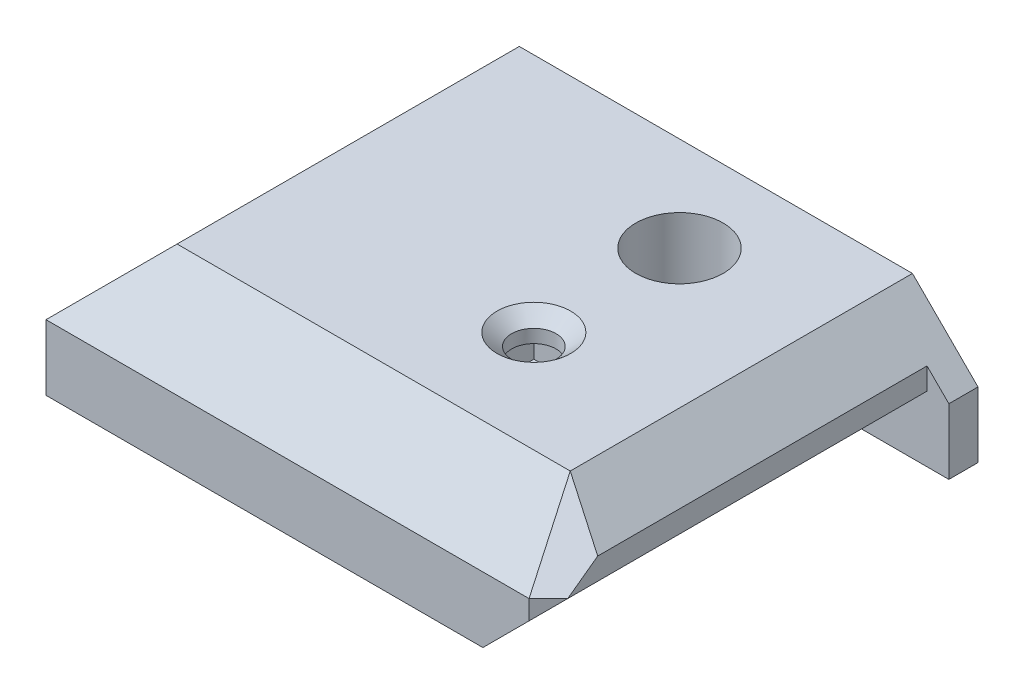
ISO-10303-21;
HEADER;
FILE_DESCRIPTION(('STEP AP214'),'2;1');
FILE_NAME('part.step','',(''),(''),'','','');
FILE_SCHEMA(('AUTOMOTIVE_DESIGN { 1 0 10303 214 1 1 1 1 }'));
ENDSEC;
DATA;
#1=APPLICATION_CONTEXT('core data for automotive mechanical design processes');
#2=APPLICATION_PROTOCOL_DEFINITION('international standard','automotive_design',2000,#1);
#3=PRODUCT_CONTEXT('',#1,'mechanical');
#4=PRODUCT('Part','Part','',(#3));
#5=PRODUCT_RELATED_PRODUCT_CATEGORY('part','',(#4));
#6=PRODUCT_DEFINITION_FORMATION('','',#4);
#7=PRODUCT_DEFINITION_CONTEXT('part definition',#1,'design');
#8=PRODUCT_DEFINITION('design','',#6,#7);
#9=PRODUCT_DEFINITION_SHAPE('','',#8);
#10=(LENGTH_UNIT() NAMED_UNIT(*) SI_UNIT(.MILLI.,.METRE.));
#11=(NAMED_UNIT(*) PLANE_ANGLE_UNIT() SI_UNIT($,.RADIAN.));
#12=(NAMED_UNIT(*) SI_UNIT($,.STERADIAN.) SOLID_ANGLE_UNIT());
#13=UNCERTAINTY_MEASURE_WITH_UNIT(LENGTH_MEASURE(1.E-05),#10,'distance_accuracy_value','');
#14=(GEOMETRIC_REPRESENTATION_CONTEXT(3) GLOBAL_UNCERTAINTY_ASSIGNED_CONTEXT((#13)) GLOBAL_UNIT_ASSIGNED_CONTEXT((#10,
#11,#12)) REPRESENTATION_CONTEXT('',''));
#15=CARTESIAN_POINT('',(0.,0.,0.));
#16=DIRECTION('',(0.,0.,1.));
#17=DIRECTION('',(1.,0.,0.));
#18=AXIS2_PLACEMENT_3D('',#15,#16,#17);
#19=CARTESIAN_POINT('',(22.,9.,16.5));
#20=DIRECTION('',(0.,1.,0.));
#21=DIRECTION('',(0.,0.,1.));
#22=AXIS2_PLACEMENT_3D('',#19,#20,#21);
#23=CYLINDRICAL_SURFACE('',#22,1.524);
#24=CARTESIAN_POINT('',(22.,8.15813134003984,16.5));
#25=DIRECTION('',(0.,1.,0.));
#26=DIRECTION('',(0.,0.,1.));
#27=AXIS2_PLACEMENT_3D('',#24,#25,#26);
#28=CIRCLE('',#27,1.524);
#29=CARTESIAN_POINT('',(22.,8.15813134003984,18.024));
#30=VERTEX_POINT('',#29);
#31=EDGE_CURVE('E218',#30,#30,#28,.T.);
#32=ORIENTED_EDGE('',*,*,#31,.T.);
#33=EDGE_LOOP('',(#32));
#34=FACE_BOUND('',#33,.T.);
#35=CARTESIAN_POINT('',(22.,7.25,16.5));
#36=DIRECTION('',(0.,-1.,0.));
#37=DIRECTION('',(0.,0.,-1.));
#38=AXIS2_PLACEMENT_3D('',#35,#36,#37);
#39=CIRCLE('',#38,1.524);
#40=CARTESIAN_POINT('',(22.,7.25,14.976));
#41=VERTEX_POINT('',#40);
#42=EDGE_CURVE('E45',#41,#41,#39,.F.);
#43=ORIENTED_EDGE('',*,*,#42,.F.);
#44=EDGE_LOOP('',(#43));
#45=FACE_BOUND('',#44,.T.);
#46=ADVANCED_FACE('F41',(#34,#45),#23,.F.);
#47=CARTESIAN_POINT('',(36.,0.,28.));
#48=DIRECTION('',(0.,1.,0.));
#49=DIRECTION('',(0.,0.,1.));
#50=AXIS2_PLACEMENT_3D('',#47,#48,#49);
#51=PLANE('',#50);
#52=CARTESIAN_POINT('',(22.,0.,16.5));
#53=DIRECTION('',(0.,1.,0.));
#54=DIRECTION('',(0.,0.,1.));
#55=AXIS2_PLACEMENT_3D('',#52,#53,#54);
#56=CIRCLE('',#55,1.524);
#57=CARTESIAN_POINT('',(22.,0.,18.024));
#58=VERTEX_POINT('',#57);
#59=EDGE_CURVE('E221',#58,#58,#56,.T.);
#60=ORIENTED_EDGE('',*,*,#59,.T.);
#61=EDGE_LOOP('',(#60));
#62=FACE_BOUND('',#61,.T.);
#63=CARTESIAN_POINT('',(22.,0.,6.5));
#64=DIRECTION('',(0.,1.,0.));
#65=DIRECTION('',(0.,0.,1.));
#66=AXIS2_PLACEMENT_3D('',#63,#64,#65);
#67=CIRCLE('',#66,1.5);
#68=CARTESIAN_POINT('',(22.,0.,8.));
#69=VERTEX_POINT('',#68);
#70=EDGE_CURVE('E227',#69,#69,#67,.F.);
#71=ORIENTED_EDGE('',*,*,#70,.F.);
#72=EDGE_LOOP('',(#71));
#73=FACE_BOUND('',#72,.T.);
#74=DIRECTION('',(1.,0.,0.));
#75=VECTOR('',#74,1.);
#76=CARTESIAN_POINT('',(36.,0.,2.));
#77=LINE('',#76,#75);
#78=CARTESIAN_POINT('',(30.,0.,2.));
#79=VERTEX_POINT('',#78);
#80=CARTESIAN_POINT('',(36.,0.,2.));
#81=VERTEX_POINT('',#80);
#82=EDGE_CURVE('E244',#79,#81,#77,.T.);
#83=ORIENTED_EDGE('',*,*,#82,.F.);
#84=DIRECTION('',(0.,0.,1.));
#85=VECTOR('',#84,1.);
#86=CARTESIAN_POINT('',(30.,0.,2.));
#87=LINE('',#86,#85);
#88=CARTESIAN_POINT('',(30.,0.,28.));
#89=VERTEX_POINT('',#88);
#90=EDGE_CURVE('E246',#79,#89,#87,.T.);
#91=ORIENTED_EDGE('',*,*,#90,.T.);
#92=DIRECTION('',(1.,0.,0.));
#93=VECTOR('',#92,1.);
#94=CARTESIAN_POINT('',(36.,0.,28.));
#95=LINE('',#94,#93);
#96=CARTESIAN_POINT('',(0.,0.,28.));
#97=VERTEX_POINT('',#96);
#98=EDGE_CURVE('E328',#97,#89,#95,.T.);
#99=ORIENTED_EDGE('',*,*,#98,.F.);
#100=DIRECTION('',(0.,0.,-1.));
#101=VECTOR('',#100,1.);
#102=CARTESIAN_POINT('',(0.,0.,28.));
#103=LINE('',#102,#101);
#104=CARTESIAN_POINT('',(0.,0.,0.));
#105=VERTEX_POINT('',#104);
#106=EDGE_CURVE('E334',#97,#105,#103,.T.);
#107=ORIENTED_EDGE('',*,*,#106,.T.);
#108=DIRECTION('',(1.,0.,0.));
#109=VECTOR('',#108,1.);
#110=CARTESIAN_POINT('',(36.,0.,0.));
#111=LINE('',#110,#109);
#112=CARTESIAN_POINT('',(5.,0.,0.));
#113=VERTEX_POINT('',#112);
#114=EDGE_CURVE('E335',#105,#113,#111,.T.);
#115=ORIENTED_EDGE('',*,*,#114,.T.);
#116=DIRECTION('',(0.,0.,-1.));
#117=VECTOR('',#116,1.);
#118=CARTESIAN_POINT('',(5.,0.,26.));
#119=LINE('',#118,#117);
#120=CARTESIAN_POINT('',(5.,0.,26.));
#121=VERTEX_POINT('',#120);
#122=EDGE_CURVE('E66',#121,#113,#119,.T.);
#123=ORIENTED_EDGE('',*,*,#122,.F.);
#124=DIRECTION('',(1.,0.,0.));
#125=VECTOR('',#124,1.);
#126=CARTESIAN_POINT('',(5.,0.,26.));
#127=LINE('',#126,#125);
#128=CARTESIAN_POINT('',(13.8116308862596,0.,26.));
#129=VERTEX_POINT('',#128);
#130=EDGE_CURVE('E258',#121,#129,#127,.T.);
#131=ORIENTED_EDGE('',*,*,#130,.T.);
#132=DIRECTION('',(0.,0.,-1.));
#133=VECTOR('',#132,1.);
#134=CARTESIAN_POINT('',(13.8116308862596,0.,26.));
#135=LINE('',#134,#133);
#136=CARTESIAN_POINT('',(13.8116308862596,0.,0.));
#137=VERTEX_POINT('',#136);
#138=EDGE_CURVE('E293',#129,#137,#135,.T.);
#139=ORIENTED_EDGE('',*,*,#138,.T.);
#140=CARTESIAN_POINT('',(36.,0.,0.));
#141=VERTEX_POINT('',#140);
#142=EDGE_CURVE('E322',#137,#141,#111,.T.);
#143=ORIENTED_EDGE('',*,*,#142,.T.);
#144=DIRECTION('',(0.,0.,-1.));
#145=VECTOR('',#144,1.);
#146=CARTESIAN_POINT('',(36.,0.,28.));
#147=LINE('',#146,#145);
#148=EDGE_CURVE('E347',#81,#141,#147,.T.);
#149=ORIENTED_EDGE('',*,*,#148,.F.);
#150=EDGE_LOOP('',(#83,#91,#99,#107,#115,#123,#131,#139,#143,#149));
#151=FACE_BOUND('',#150,.T.);
#152=ADVANCED_FACE('F43',(#62,#73,#151),#51,.F.);
#153=CARTESIAN_POINT('',(0.,0.,0.));
#154=DIRECTION('',(0.,0.,-1.));
#155=DIRECTION('',(-1.,0.,0.));
#156=AXIS2_PLACEMENT_3D('',#153,#154,#155);
#157=PLANE('',#156);
#158=ORIENTED_EDGE('',*,*,#142,.F.);
#159=DIRECTION('',(0.,1.,0.));
#160=VECTOR('',#159,1.);
#161=CARTESIAN_POINT('',(13.8116308862596,0.,0.));
#162=LINE('',#161,#160);
#163=CARTESIAN_POINT('',(13.8116308862596,3.,0.));
#164=VERTEX_POINT('',#163);
#165=EDGE_CURVE('E257',#137,#164,#162,.T.);
#166=ORIENTED_EDGE('',*,*,#165,.T.);
#167=DIRECTION('',(-0.707106781186551,0.707106781186544,0.));
#168=VECTOR('',#167,1.);
#169=CARTESIAN_POINT('',(13.8116308862596,3.,0.));
#170=LINE('',#169,#168);
#171=CARTESIAN_POINT('',(13.104524105073,3.70710678118655,0.));
#172=VERTEX_POINT('',#171);
#173=EDGE_CURVE('E274',#164,#172,#170,.T.);
#174=ORIENTED_EDGE('',*,*,#173,.T.);
#175=DIRECTION('',(-1.,0.,0.));
#176=VECTOR('',#175,1.);
#177=CARTESIAN_POINT('',(5.70710678118655,3.70710678118655,0.));
#178=LINE('',#177,#176);
#179=CARTESIAN_POINT('',(5.70710678118655,3.70710678118655,0.));
#180=VERTEX_POINT('',#179);
#181=EDGE_CURVE('E277',#172,#180,#178,.T.);
#182=ORIENTED_EDGE('',*,*,#181,.T.);
#183=DIRECTION('',(-0.707106781186547,-0.707106781186547,0.));
#184=VECTOR('',#183,1.);
#185=CARTESIAN_POINT('',(5.,3.,0.));
#186=LINE('',#185,#184);
#187=CARTESIAN_POINT('',(5.,3.,0.));
#188=VERTEX_POINT('',#187);
#189=EDGE_CURVE('E280',#180,#188,#186,.T.);
#190=ORIENTED_EDGE('',*,*,#189,.T.);
#191=DIRECTION('',(0.,-1.,0.));
#192=VECTOR('',#191,1.);
#193=CARTESIAN_POINT('',(5.,0.,0.));
#194=LINE('',#193,#192);
#195=EDGE_CURVE('E262',#188,#113,#194,.T.);
#196=ORIENTED_EDGE('',*,*,#195,.T.);
#197=ORIENTED_EDGE('',*,*,#114,.F.);
#198=DIRECTION('',(0.,-1.,0.));
#199=VECTOR('',#198,1.);
#200=CARTESIAN_POINT('',(0.,0.,0.));
#201=LINE('',#200,#199);
#202=CARTESIAN_POINT('',(0.,4.5,0.));
#203=VERTEX_POINT('',#202);
#204=EDGE_CURVE('E332',#203,#105,#201,.T.);
#205=ORIENTED_EDGE('',*,*,#204,.F.);
#206=DIRECTION('',(0.707106781186546,0.707106781186549,0.));
#207=VECTOR('',#206,1.);
#208=CARTESIAN_POINT('',(0.,4.5,0.));
#209=LINE('',#208,#207);
#210=CARTESIAN_POINT('',(4.49999999999998,9.,0.));
#211=VERTEX_POINT('',#210);
#212=EDGE_CURVE('E313',#203,#211,#209,.T.);
#213=ORIENTED_EDGE('',*,*,#212,.T.);
#214=DIRECTION('',(-1.,0.,0.));
#215=VECTOR('',#214,1.);
#216=CARTESIAN_POINT('',(0.,9.,0.));
#217=LINE('',#216,#215);
#218=CARTESIAN_POINT('',(31.5,9.,0.));
#219=VERTEX_POINT('',#218);
#220=EDGE_CURVE('E341',#219,#211,#217,.T.);
#221=ORIENTED_EDGE('',*,*,#220,.F.);
#222=DIRECTION('',(0.707106781186546,-0.707106781186549,0.));
#223=VECTOR('',#222,1.);
#224=CARTESIAN_POINT('',(36.,4.5,0.));
#225=LINE('',#224,#223);
#226=CARTESIAN_POINT('',(36.,4.50000000000001,0.));
#227=VERTEX_POINT('',#226);
#228=EDGE_CURVE('E317',#219,#227,#225,.T.);
#229=ORIENTED_EDGE('',*,*,#228,.T.);
#230=DIRECTION('',(0.,1.,0.));
#231=VECTOR('',#230,1.);
#232=CARTESIAN_POINT('',(36.,9.,0.));
#233=LINE('',#232,#231);
#234=EDGE_CURVE('E338',#141,#227,#233,.T.);
#235=ORIENTED_EDGE('',*,*,#234,.F.);
#236=EDGE_LOOP('',(#158,#166,#174,#182,#190,#196,#197,#205,#213,#221,#229,#235));
#237=FACE_BOUND('',#236,.T.);
#238=ADVANCED_FACE('F381',(#237),#157,.T.);
#239=CARTESIAN_POINT('',(36.,4.5,28.));
#240=DIRECTION('',(0.707106781186549,0.707106781186547,0.));
#241=DIRECTION('',(-0.707106781186546,0.707106781186549,0.));
#242=AXIS2_PLACEMENT_3D('',#239,#240,#241);
#243=PLANE('',#242);
#244=DIRECTION('',(0.,0.,1.));
#245=VECTOR('',#244,1.);
#246=CARTESIAN_POINT('',(34.5,5.99999999999998,2.));
#247=LINE('',#246,#245);
#248=CARTESIAN_POINT('',(34.5,5.99999999999998,2.));
#249=VERTEX_POINT('',#248);
#250=CARTESIAN_POINT('',(34.5,5.99999999999998,24.6143819168359));
#251=VERTEX_POINT('',#250);
#252=EDGE_CURVE('E58',#249,#251,#247,.T.);
#253=ORIENTED_EDGE('',*,*,#252,.F.);
#254=DIRECTION('',(-0.707106781186546,0.707106781186549,0.));
#255=VECTOR('',#254,1.);
#256=CARTESIAN_POINT('',(36.,4.5,2.));
#257=LINE('',#256,#255);
#258=CARTESIAN_POINT('',(36.,4.50000000000001,2.));
#259=VERTEX_POINT('',#258);
#260=EDGE_CURVE('E249',#259,#249,#257,.T.);
#261=ORIENTED_EDGE('',*,*,#260,.F.);
#262=DIRECTION('',(0.,0.,-1.));
#263=VECTOR('',#262,1.);
#264=CARTESIAN_POINT('',(36.,4.5,28.));
#265=LINE('',#264,#263);
#266=EDGE_CURVE('E324',#259,#227,#265,.T.);
#267=ORIENTED_EDGE('',*,*,#266,.T.);
#268=ORIENTED_EDGE('',*,*,#228,.F.);
#269=DIRECTION('',(0.,0.,-1.));
#270=VECTOR('',#269,1.);
#271=CARTESIAN_POINT('',(31.5,9.,28.));
#272=LINE('',#271,#270);
#273=CARTESIAN_POINT('',(31.5,9.,23.5));
#274=VERTEX_POINT('',#273);
#275=EDGE_CURVE('E312',#274,#219,#272,.T.);
#276=ORIENTED_EDGE('',*,*,#275,.F.);
#277=DIRECTION('',(0.683908301776168,-0.68390830177617,0.254045014757763));
#278=VECTOR('',#277,1.);
#279=CARTESIAN_POINT('',(36.4914208129248,4.00857918707516,25.3541163644139));
#280=LINE('',#279,#278);
#281=EDGE_CURVE('E302',#274,#251,#280,.T.);
#282=ORIENTED_EDGE('',*,*,#281,.T.);
#283=EDGE_LOOP('',(#253,#261,#267,#268,#276,#282));
#284=FACE_BOUND('',#283,.T.);
#285=ADVANCED_FACE('F374',(#284),#243,.T.);
#286=CARTESIAN_POINT('',(36.,4.5,28.));
#287=DIRECTION('',(0.,0.707106781186546,0.707106781186549));
#288=DIRECTION('',(0.,-0.707106781186549,0.707106781186546));
#289=AXIS2_PLACEMENT_3D('',#286,#287,#288);
#290=PLANE('',#289);
#291=DIRECTION('',(-1.,0.,0.));
#292=VECTOR('',#291,1.);
#293=CARTESIAN_POINT('',(36.,4.5,28.));
#294=LINE('',#293,#292);
#295=CARTESIAN_POINT('',(33.1715728752538,4.5,28.));
#296=VERTEX_POINT('',#295);
#297=CARTESIAN_POINT('',(0.,4.5,28.));
#298=VERTEX_POINT('',#297);
#299=EDGE_CURVE('E310',#296,#298,#294,.T.);
#300=ORIENTED_EDGE('',*,*,#299,.F.);
#301=DIRECTION('',(-0.254045014757767,0.68390830177617,-0.683908301776167));
#302=VECTOR('',#301,1.);
#303=CARTESIAN_POINT('',(33.3541163644139,4.00857918707515,28.4914208129248));
#304=LINE('',#303,#302);
#305=EDGE_CURVE('E299',#296,#274,#304,.T.);
#306=ORIENTED_EDGE('',*,*,#305,.T.);
#307=DIRECTION('',(-1.,0.,0.));
#308=VECTOR('',#307,1.);
#309=CARTESIAN_POINT('',(36.,9.,23.5));
#310=LINE('',#309,#308);
#311=CARTESIAN_POINT('',(4.49999999999998,9.,23.5));
#312=VERTEX_POINT('',#311);
#313=EDGE_CURVE('E308',#274,#312,#310,.T.);
#314=ORIENTED_EDGE('',*,*,#313,.T.);
#315=DIRECTION('',(0.577350269189625,0.577350269189627,-0.577350269189625));
#316=VECTOR('',#315,1.);
#317=CARTESIAN_POINT('',(0.,4.5,28.));
#318=LINE('',#317,#316);
#319=EDGE_CURVE('E349',#298,#312,#318,.T.);
#320=ORIENTED_EDGE('',*,*,#319,.F.);
#321=EDGE_LOOP('',(#300,#306,#314,#320));
#322=FACE_BOUND('',#321,.T.);
#323=ADVANCED_FACE('F366',(#322),#290,.T.);
#324=CARTESIAN_POINT('',(30.585786437627,0.,30.5857864376269));
#325=DIRECTION('',(0.707106781186549,0.,0.707106781186546));
#326=DIRECTION('',(0.707106781186546,0.,-0.707106781186549));
#327=AXIS2_PLACEMENT_3D('',#324,#325,#326);
#328=PLANE('',#327);
#329=DIRECTION('',(-0.577350269189626,-0.577350269189623,0.577350269189628));
#330=VECTOR('',#329,1.);
#331=CARTESIAN_POINT('',(30.3905242917513,0.390524291751312,30.7810485835025));
#332=LINE('',#331,#330);
#333=CARTESIAN_POINT('',(34.5,4.5,26.6715728752538));
#334=VERTEX_POINT('',#333);
#335=CARTESIAN_POINT('',(33.1715728752538,3.17157287525381,28.));
#336=VERTEX_POINT('',#335);
#337=EDGE_CURVE('E255',#334,#336,#332,.T.);
#338=ORIENTED_EDGE('',*,*,#337,.F.);
#339=DIRECTION('',(0.707106781186546,0.,-0.707106781186549));
#340=VECTOR('',#339,1.);
#341=CARTESIAN_POINT('',(33.1715728752538,4.5,28.));
#342=LINE('',#341,#340);
#343=EDGE_CURVE('E296',#296,#334,#342,.T.);
#344=ORIENTED_EDGE('',*,*,#343,.F.);
#345=DIRECTION('',(0.,-1.,0.));
#346=VECTOR('',#345,1.);
#347=CARTESIAN_POINT('',(33.1715728752538,0.,28.));
#348=LINE('',#347,#346);
#349=EDGE_CURVE('E305',#296,#336,#348,.T.);
#350=ORIENTED_EDGE('',*,*,#349,.T.);
#351=EDGE_LOOP('',(#338,#344,#350));
#352=FACE_BOUND('',#351,.T.);
#353=ADVANCED_FACE('F360',(#352),#328,.T.);
#354=CARTESIAN_POINT('',(0.,0.,28.));
#355=DIRECTION('',(0.,0.,-1.));
#356=DIRECTION('',(-1.,0.,0.));
#357=AXIS2_PLACEMENT_3D('',#354,#355,#356);
#358=PLANE('',#357);
#359=ORIENTED_EDGE('',*,*,#98,.T.);
#360=DIRECTION('',(0.70710678118655,0.707106781186545,0.));
#361=VECTOR('',#360,1.);
#362=CARTESIAN_POINT('',(14.9999999999999,-15.,28.));
#363=LINE('',#362,#361);
#364=EDGE_CURVE('E11',#89,#336,#363,.T.);
#365=ORIENTED_EDGE('',*,*,#364,.T.);
#366=ORIENTED_EDGE('',*,*,#349,.F.);
#367=ORIENTED_EDGE('',*,*,#299,.T.);
#368=DIRECTION('',(0.,-1.,0.));
#369=VECTOR('',#368,1.);
#370=CARTESIAN_POINT('',(0.,0.,28.));
#371=LINE('',#370,#369);
#372=EDGE_CURVE('E331',#298,#97,#371,.T.);
#373=ORIENTED_EDGE('',*,*,#372,.T.);
#374=EDGE_LOOP('',(#359,#365,#366,#367,#373));
#375=FACE_BOUND('',#374,.T.);
#376=ADVANCED_FACE('F393',(#375),#358,.F.);
#377=CARTESIAN_POINT('',(36.,9.,28.));
#378=DIRECTION('',(-1.,0.,0.));
#379=DIRECTION('',(0.,0.,1.));
#380=AXIS2_PLACEMENT_3D('',#377,#378,#379);
#381=PLANE('',#380);
#382=ORIENTED_EDGE('',*,*,#266,.F.);
#383=DIRECTION('',(0.,1.,0.));
#384=VECTOR('',#383,1.);
#385=CARTESIAN_POINT('',(36.,5.99999999999998,2.));
#386=LINE('',#385,#384);
#387=EDGE_CURVE('E234',#81,#259,#386,.T.);
#388=ORIENTED_EDGE('',*,*,#387,.F.);
#389=ORIENTED_EDGE('',*,*,#148,.T.);
#390=ORIENTED_EDGE('',*,*,#234,.T.);
#391=EDGE_LOOP('',(#382,#388,#389,#390));
#392=FACE_BOUND('',#391,.T.);
#393=ADVANCED_FACE('F402',(#392),#381,.F.);
#394=CARTESIAN_POINT('',(0.,9.,28.));
#395=DIRECTION('',(0.,-1.,0.));
#396=DIRECTION('',(0.,0.,-1.));
#397=AXIS2_PLACEMENT_3D('',#394,#395,#396);
#398=PLANE('',#397);
#399=CARTESIAN_POINT('',(22.,9.,16.5));
#400=DIRECTION('',(0.,1.,0.));
#401=DIRECTION('',(0.,0.,1.));
#402=AXIS2_PLACEMENT_3D('',#399,#400,#401);
#403=CIRCLE('',#402,2.5273);
#404=CARTESIAN_POINT('',(22.,9.,19.0273));
#405=VERTEX_POINT('',#404);
#406=EDGE_CURVE('E215',#405,#405,#403,.T.);
#407=ORIENTED_EDGE('',*,*,#406,.F.);
#408=EDGE_LOOP('',(#407));
#409=FACE_BOUND('',#408,.T.);
#410=CARTESIAN_POINT('',(22.,9.,6.5));
#411=DIRECTION('',(0.,1.,0.));
#412=DIRECTION('',(0.,0.,1.));
#413=AXIS2_PLACEMENT_3D('',#410,#411,#412);
#414=CIRCLE('',#413,3.);
#415=CARTESIAN_POINT('',(22.,9.,9.5));
#416=VERTEX_POINT('',#415);
#417=EDGE_CURVE('E230',#416,#416,#414,.T.);
#418=ORIENTED_EDGE('',*,*,#417,.F.);
#419=EDGE_LOOP('',(#418));
#420=FACE_BOUND('',#419,.T.);
#421=ORIENTED_EDGE('',*,*,#313,.F.);
#422=ORIENTED_EDGE('',*,*,#275,.T.);
#423=ORIENTED_EDGE('',*,*,#220,.T.);
#424=DIRECTION('',(0.,0.,-1.));
#425=VECTOR('',#424,1.);
#426=CARTESIAN_POINT('',(4.49999999999998,9.,28.));
#427=LINE('',#426,#425);
#428=EDGE_CURVE('E316',#312,#211,#427,.T.);
#429=ORIENTED_EDGE('',*,*,#428,.F.);
#430=EDGE_LOOP('',(#421,#422,#423,#429));
#431=FACE_BOUND('',#430,.T.);
#432=ADVANCED_FACE('F371',(#409,#420,#431),#398,.F.);
#433=CARTESIAN_POINT('',(0.,4.5,28.));
#434=DIRECTION('',(-0.707106781186549,0.707106781186546,0.));
#435=DIRECTION('',(-0.707106781186546,-0.707106781186549,0.));
#436=AXIS2_PLACEMENT_3D('',#433,#434,#435);
#437=PLANE('',#436);
#438=DIRECTION('',(0.,0.,-1.));
#439=VECTOR('',#438,1.);
#440=CARTESIAN_POINT('',(0.,4.5,28.));
#441=LINE('',#440,#439);
#442=EDGE_CURVE('E319',#298,#203,#441,.T.);
#443=ORIENTED_EDGE('',*,*,#442,.F.);
#444=ORIENTED_EDGE('',*,*,#319,.T.);
#445=ORIENTED_EDGE('',*,*,#428,.T.);
#446=ORIENTED_EDGE('',*,*,#212,.F.);
#447=EDGE_LOOP('',(#443,#444,#445,#446));
#448=FACE_BOUND('',#447,.T.);
#449=ADVANCED_FACE('F386',(#448),#437,.T.);
#450=CARTESIAN_POINT('',(0.,0.,28.));
#451=DIRECTION('',(1.,0.,0.));
#452=DIRECTION('',(0.,0.,-1.));
#453=AXIS2_PLACEMENT_3D('',#450,#451,#452);
#454=PLANE('',#453);
#455=ORIENTED_EDGE('',*,*,#442,.T.);
#456=ORIENTED_EDGE('',*,*,#204,.T.);
#457=ORIENTED_EDGE('',*,*,#106,.F.);
#458=ORIENTED_EDGE('',*,*,#372,.F.);
#459=EDGE_LOOP('',(#455,#456,#457,#458));
#460=FACE_BOUND('',#459,.T.);
#461=ADVANCED_FACE('F389',(#460),#454,.F.);
#462=CARTESIAN_POINT('',(30.0857864376269,9.00000000000001,24.9142135623731));
#463=DIRECTION('',(0.507613933017222,0.696172528913327,0.507613933017219));
#464=DIRECTION('',(-0.808014088376717,0.589163163295826,0.));
#465=AXIS2_PLACEMENT_3D('',#462,#463,#464);
#466=PLANE('',#465);
#467=DIRECTION('',(0.,-0.589163163295823,0.808014088376719));
#468=VECTOR('',#467,1.);
#469=CARTESIAN_POINT('',(34.5,6.89860420356718,23.3819816216527));
#470=LINE('',#469,#468);
#471=EDGE_CURVE('E50',#251,#334,#470,.T.);
#472=ORIENTED_EDGE('',*,*,#471,.F.);
#473=ORIENTED_EDGE('',*,*,#281,.F.);
#474=ORIENTED_EDGE('',*,*,#305,.F.);
#475=ORIENTED_EDGE('',*,*,#343,.T.);
#476=EDGE_LOOP('',(#472,#473,#474,#475));
#477=FACE_BOUND('',#476,.T.);
#478=ADVANCED_FACE('F362',(#477),#466,.T.);
#479=CARTESIAN_POINT('',(13.8116308862596,0.,26.));
#480=DIRECTION('',(-1.,0.,0.));
#481=DIRECTION('',(0.,0.,1.));
#482=AXIS2_PLACEMENT_3D('',#479,#480,#481);
#483=PLANE('',#482);
#484=ORIENTED_EDGE('',*,*,#165,.F.);
#485=ORIENTED_EDGE('',*,*,#138,.F.);
#486=DIRECTION('',(0.,1.,0.));
#487=VECTOR('',#486,1.);
#488=CARTESIAN_POINT('',(13.8116308862596,0.,26.));
#489=LINE('',#488,#487);
#490=CARTESIAN_POINT('',(13.8116308862596,3.,26.));
#491=VERTEX_POINT('',#490);
#492=EDGE_CURVE('E261',#129,#491,#489,.T.);
#493=ORIENTED_EDGE('',*,*,#492,.T.);
#494=DIRECTION('',(0.,0.,-1.));
#495=VECTOR('',#494,1.);
#496=CARTESIAN_POINT('',(13.8116308862596,3.,26.));
#497=LINE('',#496,#495);
#498=EDGE_CURVE('E291',#491,#164,#497,.T.);
#499=ORIENTED_EDGE('',*,*,#498,.T.);
#500=EDGE_LOOP('',(#484,#485,#493,#499));
#501=FACE_BOUND('',#500,.T.);
#502=ADVANCED_FACE('F406',(#501),#483,.T.);
#503=CARTESIAN_POINT('',(13.8116308862596,3.,26.));
#504=DIRECTION('',(-0.707106781186544,-0.707106781186551,0.));
#505=DIRECTION('',(0.707106781186551,-0.707106781186544,0.));
#506=AXIS2_PLACEMENT_3D('',#503,#504,#505);
#507=PLANE('',#506);
#508=ORIENTED_EDGE('',*,*,#173,.F.);
#509=ORIENTED_EDGE('',*,*,#498,.F.);
#510=DIRECTION('',(-0.707106781186551,0.707106781186544,0.));
#511=VECTOR('',#510,1.);
#512=CARTESIAN_POINT('',(13.8116308862596,3.,26.));
#513=LINE('',#512,#511);
#514=CARTESIAN_POINT('',(13.104524105073,3.70710678118655,26.));
#515=VERTEX_POINT('',#514);
#516=EDGE_CURVE('E264',#491,#515,#513,.T.);
#517=ORIENTED_EDGE('',*,*,#516,.T.);
#518=DIRECTION('',(0.,0.,-1.));
#519=VECTOR('',#518,1.);
#520=CARTESIAN_POINT('',(13.104524105073,3.70710678118655,26.));
#521=LINE('',#520,#519);
#522=EDGE_CURVE('E289',#515,#172,#521,.T.);
#523=ORIENTED_EDGE('',*,*,#522,.T.);
#524=EDGE_LOOP('',(#508,#509,#517,#523));
#525=FACE_BOUND('',#524,.T.);
#526=ADVANCED_FACE('F411',(#525),#507,.T.);
#527=CARTESIAN_POINT('',(5.70710678118655,3.70710678118655,26.));
#528=DIRECTION('',(0.,-1.,0.));
#529=DIRECTION('',(0.,0.,-1.));
#530=AXIS2_PLACEMENT_3D('',#527,#528,#529);
#531=PLANE('',#530);
#532=ORIENTED_EDGE('',*,*,#181,.F.);
#533=ORIENTED_EDGE('',*,*,#522,.F.);
#534=DIRECTION('',(-1.,0.,0.));
#535=VECTOR('',#534,1.);
#536=CARTESIAN_POINT('',(5.70710678118655,3.70710678118655,26.));
#537=LINE('',#536,#535);
#538=CARTESIAN_POINT('',(5.70710678118655,3.70710678118655,26.));
#539=VERTEX_POINT('',#538);
#540=EDGE_CURVE('E266',#515,#539,#537,.T.);
#541=ORIENTED_EDGE('',*,*,#540,.T.);
#542=DIRECTION('',(0.,0.,-1.));
#543=VECTOR('',#542,1.);
#544=CARTESIAN_POINT('',(5.70710678118655,3.70710678118655,26.));
#545=LINE('',#544,#543);
#546=EDGE_CURVE('E287',#539,#180,#545,.T.);
#547=ORIENTED_EDGE('',*,*,#546,.T.);
#548=EDGE_LOOP('',(#532,#533,#541,#547));
#549=FACE_BOUND('',#548,.T.);
#550=ADVANCED_FACE('F416',(#549),#531,.T.);
#551=CARTESIAN_POINT('',(5.,3.,26.));
#552=DIRECTION('',(0.707106781186548,-0.707106781186548,0.));
#553=DIRECTION('',(0.707106781186548,0.707106781186548,0.));
#554=AXIS2_PLACEMENT_3D('',#551,#552,#553);
#555=PLANE('',#554);
#556=ORIENTED_EDGE('',*,*,#189,.F.);
#557=ORIENTED_EDGE('',*,*,#546,.F.);
#558=DIRECTION('',(-0.707106781186547,-0.707106781186547,0.));
#559=VECTOR('',#558,1.);
#560=CARTESIAN_POINT('',(5.,3.,26.));
#561=LINE('',#560,#559);
#562=CARTESIAN_POINT('',(5.,3.,26.));
#563=VERTEX_POINT('',#562);
#564=EDGE_CURVE('E268',#539,#563,#561,.T.);
#565=ORIENTED_EDGE('',*,*,#564,.T.);
#566=DIRECTION('',(0.,0.,-1.));
#567=VECTOR('',#566,1.);
#568=CARTESIAN_POINT('',(5.,3.,26.));
#569=LINE('',#568,#567);
#570=EDGE_CURVE('E285',#563,#188,#569,.T.);
#571=ORIENTED_EDGE('',*,*,#570,.T.);
#572=EDGE_LOOP('',(#556,#557,#565,#571));
#573=FACE_BOUND('',#572,.T.);
#574=ADVANCED_FACE('F421',(#573),#555,.T.);
#575=CARTESIAN_POINT('',(5.,0.,26.));
#576=DIRECTION('',(1.,0.,0.));
#577=DIRECTION('',(0.,0.,-1.));
#578=AXIS2_PLACEMENT_3D('',#575,#576,#577);
#579=PLANE('',#578);
#580=ORIENTED_EDGE('',*,*,#195,.F.);
#581=ORIENTED_EDGE('',*,*,#570,.F.);
#582=DIRECTION('',(0.,-1.,0.));
#583=VECTOR('',#582,1.);
#584=CARTESIAN_POINT('',(5.,0.,26.));
#585=LINE('',#584,#583);
#586=EDGE_CURVE('E270',#563,#121,#585,.T.);
#587=ORIENTED_EDGE('',*,*,#586,.T.);
#588=ORIENTED_EDGE('',*,*,#122,.T.);
#589=EDGE_LOOP('',(#580,#581,#587,#588));
#590=FACE_BOUND('',#589,.T.);
#591=ADVANCED_FACE('F424',(#590),#579,.T.);
#592=CARTESIAN_POINT('',(0.,0.,26.));
#593=DIRECTION('',(0.,0.,1.));
#594=DIRECTION('',(1.,0.,0.));
#595=AXIS2_PLACEMENT_3D('',#592,#593,#594);
#596=PLANE('',#595);
#597=ORIENTED_EDGE('',*,*,#130,.F.);
#598=ORIENTED_EDGE('',*,*,#586,.F.);
#599=ORIENTED_EDGE('',*,*,#564,.F.);
#600=ORIENTED_EDGE('',*,*,#540,.F.);
#601=ORIENTED_EDGE('',*,*,#516,.F.);
#602=ORIENTED_EDGE('',*,*,#492,.F.);
#603=EDGE_LOOP('',(#597,#598,#599,#600,#601,#602));
#604=FACE_BOUND('',#603,.T.);
#605=ADVANCED_FACE('F426',(#604),#596,.F.);
#606=CARTESIAN_POINT('',(34.5,4.5,2.));
#607=DIRECTION('',(-0.707106781186545,0.70710678118655,0.));
#608=DIRECTION('',(-0.70710678118655,-0.707106781186545,0.));
#609=AXIS2_PLACEMENT_3D('',#606,#607,#608);
#610=PLANE('',#609);
#611=ORIENTED_EDGE('',*,*,#337,.T.);
#612=ORIENTED_EDGE('',*,*,#364,.F.);
#613=ORIENTED_EDGE('',*,*,#90,.F.);
#614=DIRECTION('',(-0.70710678118655,-0.707106781186545,0.));
#615=VECTOR('',#614,1.);
#616=CARTESIAN_POINT('',(34.5,4.5,2.));
#617=LINE('',#616,#615);
#618=CARTESIAN_POINT('',(34.5,4.5,2.));
#619=VERTEX_POINT('',#618);
#620=EDGE_CURVE('E241',#619,#79,#617,.T.);
#621=ORIENTED_EDGE('',*,*,#620,.F.);
#622=DIRECTION('',(0.,0.,1.));
#623=VECTOR('',#622,1.);
#624=CARTESIAN_POINT('',(34.5,4.5,2.));
#625=LINE('',#624,#623);
#626=EDGE_CURVE('E250',#619,#334,#625,.T.);
#627=ORIENTED_EDGE('',*,*,#626,.T.);
#628=EDGE_LOOP('',(#611,#612,#613,#621,#627));
#629=FACE_BOUND('',#628,.T.);
#630=ADVANCED_FACE('F357',(#629),#610,.F.);
#631=CARTESIAN_POINT('',(34.5,4.5,2.));
#632=DIRECTION('',(-1.,0.,0.));
#633=DIRECTION('',(0.,0.,1.));
#634=AXIS2_PLACEMENT_3D('',#631,#632,#633);
#635=PLANE('',#634);
#636=ORIENTED_EDGE('',*,*,#471,.T.);
#637=ORIENTED_EDGE('',*,*,#626,.F.);
#638=DIRECTION('',(0.,-1.,0.));
#639=VECTOR('',#638,1.);
#640=CARTESIAN_POINT('',(34.5,4.5,2.));
#641=LINE('',#640,#639);
#642=EDGE_CURVE('E238',#249,#619,#641,.T.);
#643=ORIENTED_EDGE('',*,*,#642,.F.);
#644=ORIENTED_EDGE('',*,*,#252,.T.);
#645=EDGE_LOOP('',(#636,#637,#643,#644));
#646=FACE_BOUND('',#645,.T.);
#647=ADVANCED_FACE('F352',(#646),#635,.F.);
#648=CARTESIAN_POINT('',(0.,0.,2.));
#649=DIRECTION('',(0.,0.,-1.));
#650=DIRECTION('',(-1.,0.,0.));
#651=AXIS2_PLACEMENT_3D('',#648,#649,#650);
#652=PLANE('',#651);
#653=ORIENTED_EDGE('',*,*,#260,.T.);
#654=ORIENTED_EDGE('',*,*,#642,.T.);
#655=ORIENTED_EDGE('',*,*,#620,.T.);
#656=ORIENTED_EDGE('',*,*,#82,.T.);
#657=ORIENTED_EDGE('',*,*,#387,.T.);
#658=EDGE_LOOP('',(#653,#654,#655,#656,#657));
#659=FACE_BOUND('',#658,.T.);
#660=ADVANCED_FACE('F400',(#659),#652,.F.);
#661=CARTESIAN_POINT('',(22.,2.,6.5));
#662=DIRECTION('',(0.,1.,0.));
#663=DIRECTION('',(0.,0.,1.));
#664=AXIS2_PLACEMENT_3D('',#661,#662,#663);
#665=CYLINDRICAL_SURFACE('',#664,3.);
#666=CARTESIAN_POINT('',(22.,2.,6.5));
#667=DIRECTION('',(0.,1.,0.));
#668=DIRECTION('',(0.,0.,1.));
#669=AXIS2_PLACEMENT_3D('',#666,#667,#668);
#670=CIRCLE('',#669,3.);
#671=CARTESIAN_POINT('',(22.,2.,9.5));
#672=VERTEX_POINT('',#671);
#673=EDGE_CURVE('E231',#672,#672,#670,.T.);
#674=ORIENTED_EDGE('',*,*,#673,.F.);
#675=EDGE_LOOP('',(#674));
#676=FACE_BOUND('',#675,.T.);
#677=ORIENTED_EDGE('',*,*,#417,.T.);
#678=EDGE_LOOP('',(#677));
#679=FACE_BOUND('',#678,.T.);
#680=ADVANCED_FACE('F468',(#676,#679),#665,.F.);
#681=CARTESIAN_POINT('',(22.,2.,6.5));
#682=DIRECTION('',(0.,1.,0.));
#683=DIRECTION('',(0.,0.,1.));
#684=AXIS2_PLACEMENT_3D('',#681,#682,#683);
#685=PLANE('',#684);
#686=CARTESIAN_POINT('',(22.,2.,6.5));
#687=DIRECTION('',(0.,1.,0.));
#688=DIRECTION('',(0.,0.,1.));
#689=AXIS2_PLACEMENT_3D('',#686,#687,#688);
#690=CIRCLE('',#689,1.5);
#691=CARTESIAN_POINT('',(22.,2.,8.));
#692=VERTEX_POINT('',#691);
#693=EDGE_CURVE('E224',#692,#692,#690,.T.);
#694=ORIENTED_EDGE('',*,*,#693,.F.);
#695=EDGE_LOOP('',(#694));
#696=FACE_BOUND('',#695,.T.);
#697=ORIENTED_EDGE('',*,*,#673,.T.);
#698=EDGE_LOOP('',(#697));
#699=FACE_BOUND('',#698,.T.);
#700=ADVANCED_FACE('F456',(#696,#699),#685,.T.);
#701=CARTESIAN_POINT('',(22.,-4.24264068711929,6.5));
#702=DIRECTION('',(0.,1.,0.));
#703=DIRECTION('',(0.,0.,1.));
#704=AXIS2_PLACEMENT_3D('',#701,#702,#703);
#705=CYLINDRICAL_SURFACE('',#704,1.5);
#706=ORIENTED_EDGE('',*,*,#70,.T.);
#707=EDGE_LOOP('',(#706));
#708=FACE_BOUND('',#707,.T.);
#709=ORIENTED_EDGE('',*,*,#693,.T.);
#710=EDGE_LOOP('',(#709));
#711=FACE_BOUND('',#710,.T.);
#712=ADVANCED_FACE('F449',(#708,#711),#705,.F.);
#713=CARTESIAN_POINT('',(22.,4.75,16.5));
#714=DIRECTION('',(0.,-1.,0.));
#715=DIRECTION('',(0.,0.,-1.));
#716=AXIS2_PLACEMENT_3D('',#713,#714,#715);
#717=CIRCLE('',#716,1.524);
#718=CARTESIAN_POINT('',(22.,4.75,14.976));
#719=VERTEX_POINT('',#718);
#720=EDGE_CURVE('E207',#719,#719,#717,.F.);
#721=ORIENTED_EDGE('',*,*,#720,.T.);
#722=EDGE_LOOP('',(#721));
#723=FACE_BOUND('',#722,.T.);
#724=ORIENTED_EDGE('',*,*,#59,.F.);
#725=EDGE_LOOP('',(#724));
#726=FACE_BOUND('',#725,.T.);
#727=ADVANCED_FACE('F438',(#723,#726),#23,.F.);
#728=CARTESIAN_POINT('',(22.,9.,16.5));
#729=DIRECTION('',(0.,1.,0.));
#730=DIRECTION('',(0.,0.,1.));
#731=AXIS2_PLACEMENT_3D('',#728,#729,#730);
#732=CONICAL_SURFACE('',#731,2.5273,0.872664625997166);
#733=ORIENTED_EDGE('',*,*,#31,.F.);
#734=EDGE_LOOP('',(#733));
#735=FACE_BOUND('',#734,.T.);
#736=ORIENTED_EDGE('',*,*,#406,.T.);
#737=EDGE_LOOP('',(#736));
#738=FACE_BOUND('',#737,.T.);
#739=ADVANCED_FACE('F448',(#735,#738),#732,.F.);
#740=CARTESIAN_POINT('',(0.,7.25,0.));
#741=DIRECTION('',(0.,-1.,0.));
#742=DIRECTION('',(0.,0.,-1.));
#743=AXIS2_PLACEMENT_3D('',#740,#741,#742);
#744=PLANE('',#743);
#745=DIRECTION('',(0.,0.,1.));
#746=VECTOR('',#745,1.);
#747=CARTESIAN_POINT('',(19.35,7.25,19.15));
#748=LINE('',#747,#746);
#749=CARTESIAN_POINT('',(19.35,7.25,13.85));
#750=VERTEX_POINT('',#749);
#751=CARTESIAN_POINT('',(19.35,7.25,19.15));
#752=VERTEX_POINT('',#751);
#753=EDGE_CURVE('E187',#750,#752,#748,.T.);
#754=ORIENTED_EDGE('',*,*,#753,.F.);
#755=DIRECTION('',(-1.,0.,0.));
#756=VECTOR('',#755,1.);
#757=CARTESIAN_POINT('',(19.35,7.25,13.85));
#758=LINE('',#757,#756);
#759=CARTESIAN_POINT('',(24.65,7.25,13.85));
#760=VERTEX_POINT('',#759);
#761=EDGE_CURVE('E646',#760,#750,#758,.T.);
#762=ORIENTED_EDGE('',*,*,#761,.F.);
#763=DIRECTION('',(0.,0.,-1.));
#764=VECTOR('',#763,1.);
#765=CARTESIAN_POINT('',(24.65,7.25,19.15));
#766=LINE('',#765,#764);
#767=CARTESIAN_POINT('',(24.65,7.25,19.15));
#768=VERTEX_POINT('',#767);
#769=EDGE_CURVE('E188',#768,#760,#766,.T.);
#770=ORIENTED_EDGE('',*,*,#769,.F.);
#771=DIRECTION('',(1.,0.,0.));
#772=VECTOR('',#771,1.);
#773=CARTESIAN_POINT('',(19.35,7.25,19.15));
#774=LINE('',#773,#772);
#775=EDGE_CURVE('E182',#752,#768,#774,.T.);
#776=ORIENTED_EDGE('',*,*,#775,.F.);
#777=EDGE_LOOP('',(#754,#762,#770,#776));
#778=FACE_BOUND('',#777,.T.);
#779=ORIENTED_EDGE('',*,*,#42,.T.);
#780=EDGE_LOOP('',(#779));
#781=FACE_BOUND('',#780,.T.);
#782=ADVANCED_FACE('F184',(#778,#781),#744,.T.);
#783=CARTESIAN_POINT('',(0.,4.75,0.));
#784=DIRECTION('',(0.,-1.,0.));
#785=DIRECTION('',(0.,0.,-1.));
#786=AXIS2_PLACEMENT_3D('',#783,#784,#785);
#787=PLANE('',#786);
#788=DIRECTION('',(0.,0.,1.));
#789=VECTOR('',#788,1.);
#790=CARTESIAN_POINT('',(19.35,4.75,19.15));
#791=LINE('',#790,#789);
#792=CARTESIAN_POINT('',(19.35,4.75,13.85));
#793=VERTEX_POINT('',#792);
#794=CARTESIAN_POINT('',(19.35,4.75,19.15));
#795=VERTEX_POINT('',#794);
#796=EDGE_CURVE('E651',#793,#795,#791,.T.);
#797=ORIENTED_EDGE('',*,*,#796,.T.);
#798=DIRECTION('',(1.,0.,0.));
#799=VECTOR('',#798,1.);
#800=CARTESIAN_POINT('',(19.35,4.75,19.15));
#801=LINE('',#800,#799);
#802=CARTESIAN_POINT('',(24.65,4.75,19.15));
#803=VERTEX_POINT('',#802);
#804=EDGE_CURVE('E206',#795,#803,#801,.T.);
#805=ORIENTED_EDGE('',*,*,#804,.T.);
#806=DIRECTION('',(0.,0.,-1.));
#807=VECTOR('',#806,1.);
#808=CARTESIAN_POINT('',(24.65,4.75,19.15));
#809=LINE('',#808,#807);
#810=CARTESIAN_POINT('',(24.65,4.75,13.85));
#811=VERTEX_POINT('',#810);
#812=EDGE_CURVE('E641',#803,#811,#809,.T.);
#813=ORIENTED_EDGE('',*,*,#812,.T.);
#814=DIRECTION('',(-1.,0.,0.));
#815=VECTOR('',#814,1.);
#816=CARTESIAN_POINT('',(19.35,4.75,13.85));
#817=LINE('',#816,#815);
#818=EDGE_CURVE('E203',#811,#793,#817,.T.);
#819=ORIENTED_EDGE('',*,*,#818,.T.);
#820=EDGE_LOOP('',(#797,#805,#813,#819));
#821=FACE_BOUND('',#820,.T.);
#822=ORIENTED_EDGE('',*,*,#720,.F.);
#823=EDGE_LOOP('',(#822));
#824=FACE_BOUND('',#823,.T.);
#825=ADVANCED_FACE('F590',(#821,#824),#787,.F.);
#826=CARTESIAN_POINT('',(19.35,7.25,19.15));
#827=DIRECTION('',(1.,0.,0.));
#828=DIRECTION('',(0.,0.,-1.));
#829=AXIS2_PLACEMENT_3D('',#826,#827,#828);
#830=PLANE('',#829);
#831=ORIENTED_EDGE('',*,*,#796,.F.);
#832=DIRECTION('',(0.,-1.,0.));
#833=VECTOR('',#832,1.);
#834=CARTESIAN_POINT('',(19.35,7.25,13.85));
#835=LINE('',#834,#833);
#836=EDGE_CURVE('E202',#750,#793,#835,.T.);
#837=ORIENTED_EDGE('',*,*,#836,.F.);
#838=ORIENTED_EDGE('',*,*,#753,.T.);
#839=DIRECTION('',(0.,-1.,0.));
#840=VECTOR('',#839,1.);
#841=CARTESIAN_POINT('',(19.35,7.25,19.15));
#842=LINE('',#841,#840);
#843=EDGE_CURVE('E199',#752,#795,#842,.T.);
#844=ORIENTED_EDGE('',*,*,#843,.T.);
#845=EDGE_LOOP('',(#831,#837,#838,#844));
#846=FACE_BOUND('',#845,.T.);
#847=ADVANCED_FACE('F198',(#846),#830,.T.);
#848=CARTESIAN_POINT('',(19.35,7.25,19.15));
#849=DIRECTION('',(0.,0.,-1.));
#850=DIRECTION('',(-1.,0.,0.));
#851=AXIS2_PLACEMENT_3D('',#848,#849,#850);
#852=PLANE('',#851);
#853=ORIENTED_EDGE('',*,*,#804,.F.);
#854=ORIENTED_EDGE('',*,*,#843,.F.);
#855=ORIENTED_EDGE('',*,*,#775,.T.);
#856=DIRECTION('',(0.,-1.,0.));
#857=VECTOR('',#856,1.);
#858=CARTESIAN_POINT('',(24.65,7.25,19.15));
#859=LINE('',#858,#857);
#860=EDGE_CURVE('E208',#768,#803,#859,.T.);
#861=ORIENTED_EDGE('',*,*,#860,.T.);
#862=EDGE_LOOP('',(#853,#854,#855,#861));
#863=FACE_BOUND('',#862,.T.);
#864=ADVANCED_FACE('F205',(#863),#852,.T.);
#865=CARTESIAN_POINT('',(24.65,7.25,19.15));
#866=DIRECTION('',(-1.,0.,0.));
#867=DIRECTION('',(0.,0.,1.));
#868=AXIS2_PLACEMENT_3D('',#865,#866,#867);
#869=PLANE('',#868);
#870=ORIENTED_EDGE('',*,*,#812,.F.);
#871=ORIENTED_EDGE('',*,*,#860,.F.);
#872=ORIENTED_EDGE('',*,*,#769,.T.);
#873=DIRECTION('',(0.,-1.,0.));
#874=VECTOR('',#873,1.);
#875=CARTESIAN_POINT('',(24.65,7.25,13.85));
#876=LINE('',#875,#874);
#877=EDGE_CURVE('E211',#760,#811,#876,.T.);
#878=ORIENTED_EDGE('',*,*,#877,.T.);
#879=EDGE_LOOP('',(#870,#871,#872,#878));
#880=FACE_BOUND('',#879,.T.);
#881=ADVANCED_FACE('F616',(#880),#869,.T.);
#882=CARTESIAN_POINT('',(19.35,7.25,13.85));
#883=DIRECTION('',(0.,0.,1.));
#884=DIRECTION('',(1.,0.,0.));
#885=AXIS2_PLACEMENT_3D('',#882,#883,#884);
#886=PLANE('',#885);
#887=ORIENTED_EDGE('',*,*,#818,.F.);
#888=ORIENTED_EDGE('',*,*,#877,.F.);
#889=ORIENTED_EDGE('',*,*,#761,.T.);
#890=ORIENTED_EDGE('',*,*,#836,.T.);
#891=EDGE_LOOP('',(#887,#888,#889,#890));
#892=FACE_BOUND('',#891,.T.);
#893=ADVANCED_FACE('F625',(#892),#886,.T.);
#894=CLOSED_SHELL('',(#46,#152,#238,#285,#323,#353,#376,#393,#432,#449,#461,#478,#502,#526,#550,
#574,#591,#605,#630,#647,#660,#680,#700,#712,#727,#739,#782,#825,#847,#864,#881,#893));
#895=MANIFOLD_SOLID_BREP('B2',#894);
#896=ADVANCED_BREP_SHAPE_REPRESENTATION('',(#18,#895),#14);
#897=SHAPE_DEFINITION_REPRESENTATION(#9,#896);
ENDSEC;
END-ISO-10303-21;
